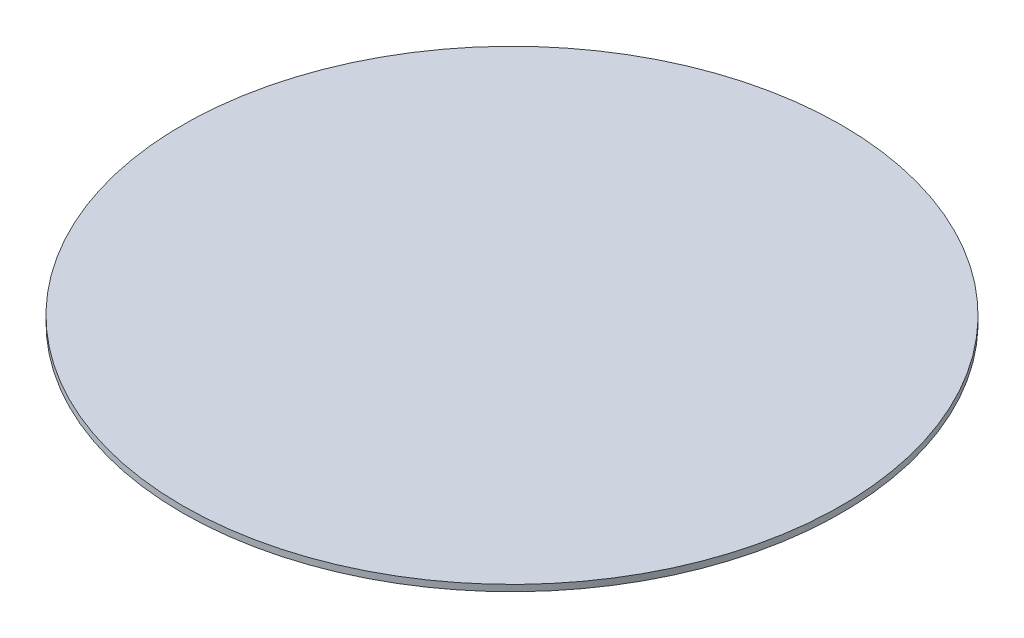
ISO-10303-21;
HEADER;
FILE_DESCRIPTION(('STEP AP214'),'2;1');
FILE_NAME('part.step','',(''),(''),'','','');
FILE_SCHEMA(('AUTOMOTIVE_DESIGN { 1 0 10303 214 1 1 1 1 }'));
ENDSEC;
DATA;
#1=APPLICATION_CONTEXT('core data for automotive mechanical design processes');
#2=APPLICATION_PROTOCOL_DEFINITION('international standard','automotive_design',2000,#1);
#3=PRODUCT_CONTEXT('',#1,'mechanical');
#4=PRODUCT('Part','Part','',(#3));
#5=PRODUCT_RELATED_PRODUCT_CATEGORY('part','',(#4));
#6=PRODUCT_DEFINITION_FORMATION('','',#4);
#7=PRODUCT_DEFINITION_CONTEXT('part definition',#1,'design');
#8=PRODUCT_DEFINITION('design','',#6,#7);
#9=PRODUCT_DEFINITION_SHAPE('','',#8);
#10=(LENGTH_UNIT() NAMED_UNIT(*) SI_UNIT(.MILLI.,.METRE.));
#11=(NAMED_UNIT(*) PLANE_ANGLE_UNIT() SI_UNIT($,.RADIAN.));
#12=(NAMED_UNIT(*) SI_UNIT($,.STERADIAN.) SOLID_ANGLE_UNIT());
#13=UNCERTAINTY_MEASURE_WITH_UNIT(LENGTH_MEASURE(1.E-05),#10,'distance_accuracy_value','');
#14=(GEOMETRIC_REPRESENTATION_CONTEXT(3) GLOBAL_UNCERTAINTY_ASSIGNED_CONTEXT((#13)) GLOBAL_UNIT_ASSIGNED_CONTEXT((#10,
#11,#12)) REPRESENTATION_CONTEXT('',''));
#15=CARTESIAN_POINT('',(0.,0.,0.));
#16=DIRECTION('',(0.,0.,1.));
#17=DIRECTION('',(1.,0.,0.));
#18=AXIS2_PLACEMENT_3D('',#15,#16,#17);
#19=CARTESIAN_POINT('',(0.,3.175,0.));
#20=DIRECTION('',(0.,-1.,0.));
#21=DIRECTION('',(0.,0.,-1.));
#22=AXIS2_PLACEMENT_3D('',#19,#20,#21);
#23=CYLINDRICAL_SURFACE('',#22,165.1);
#24=CARTESIAN_POINT('',(0.,3.175,0.));
#25=DIRECTION('',(0.,1.,0.));
#26=DIRECTION('',(0.,0.,1.));
#27=AXIS2_PLACEMENT_3D('',#24,#25,#26);
#28=CIRCLE('',#27,165.1);
#29=CARTESIAN_POINT('',(0.,3.175,165.1));
#30=VERTEX_POINT('',#29);
#31=EDGE_CURVE('E10',#30,#30,#28,.T.);
#32=ORIENTED_EDGE('',*,*,#31,.F.);
#33=EDGE_LOOP('',(#32));
#34=FACE_BOUND('',#33,.T.);
#35=CARTESIAN_POINT('',(0.,0.,0.));
#36=DIRECTION('',(0.,1.,0.));
#37=DIRECTION('',(0.,0.,1.));
#38=AXIS2_PLACEMENT_3D('',#35,#36,#37);
#39=CIRCLE('',#38,165.1);
#40=CARTESIAN_POINT('',(0.,0.,165.1));
#41=VERTEX_POINT('',#40);
#42=EDGE_CURVE('E34',#41,#41,#39,.T.);
#43=ORIENTED_EDGE('',*,*,#42,.T.);
#44=EDGE_LOOP('',(#43));
#45=FACE_BOUND('',#44,.T.);
#46=ADVANCED_FACE('F31',(#34,#45),#23,.T.);
#47=CARTESIAN_POINT('',(0.,3.175,0.));
#48=DIRECTION('',(0.,1.,0.));
#49=DIRECTION('',(0.,0.,1.));
#50=AXIS2_PLACEMENT_3D('',#47,#48,#49);
#51=PLANE('',#50);
#52=ORIENTED_EDGE('',*,*,#31,.T.);
#53=EDGE_LOOP('',(#52));
#54=FACE_BOUND('',#53,.T.);
#55=ADVANCED_FACE('F46',(#54),#51,.T.);
#56=CARTESIAN_POINT('',(0.,0.,0.));
#57=DIRECTION('',(0.,1.,0.));
#58=DIRECTION('',(0.,0.,1.));
#59=AXIS2_PLACEMENT_3D('',#56,#57,#58);
#60=PLANE('',#59);
#61=ORIENTED_EDGE('',*,*,#42,.F.);
#62=EDGE_LOOP('',(#61));
#63=FACE_BOUND('',#62,.T.);
#64=ADVANCED_FACE('F44',(#63),#60,.F.);
#65=CLOSED_SHELL('',(#46,#55,#64));
#66=MANIFOLD_SOLID_BREP('B2',#65);
#67=ADVANCED_BREP_SHAPE_REPRESENTATION('',(#18,#66),#14);
#68=SHAPE_DEFINITION_REPRESENTATION(#9,#67);
ENDSEC;
END-ISO-10303-21;
